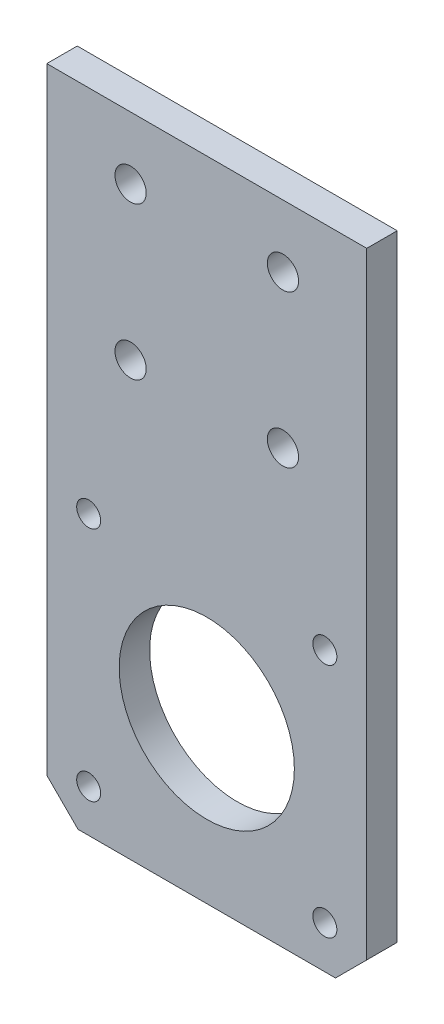
ISO-10303-21;
HEADER;
FILE_DESCRIPTION(('STEP AP214'),'2;1');
FILE_NAME('part.step','',(''),(''),'','','');
FILE_SCHEMA(('AUTOMOTIVE_DESIGN { 1 0 10303 214 1 1 1 1 }'));
ENDSEC;
DATA;
#1=APPLICATION_CONTEXT('core data for automotive mechanical design processes');
#2=APPLICATION_PROTOCOL_DEFINITION('international standard','automotive_design',2000,#1);
#3=PRODUCT_CONTEXT('',#1,'mechanical');
#4=PRODUCT('Part','Part','',(#3));
#5=PRODUCT_RELATED_PRODUCT_CATEGORY('part','',(#4));
#6=PRODUCT_DEFINITION_FORMATION('','',#4);
#7=PRODUCT_DEFINITION_CONTEXT('part definition',#1,'design');
#8=PRODUCT_DEFINITION('design','',#6,#7);
#9=PRODUCT_DEFINITION_SHAPE('','',#8);
#10=(LENGTH_UNIT() NAMED_UNIT(*) SI_UNIT(.MILLI.,.METRE.));
#11=(NAMED_UNIT(*) PLANE_ANGLE_UNIT() SI_UNIT($,.RADIAN.));
#12=(NAMED_UNIT(*) SI_UNIT($,.STERADIAN.) SOLID_ANGLE_UNIT());
#13=UNCERTAINTY_MEASURE_WITH_UNIT(LENGTH_MEASURE(1.E-05),#10,'distance_accuracy_value','');
#14=(GEOMETRIC_REPRESENTATION_CONTEXT(3) GLOBAL_UNCERTAINTY_ASSIGNED_CONTEXT((#13)) GLOBAL_UNIT_ASSIGNED_CONTEXT((#10,
#11,#12)) REPRESENTATION_CONTEXT('',''));
#15=CARTESIAN_POINT('',(0.,0.,0.));
#16=DIRECTION('',(0.,0.,1.));
#17=DIRECTION('',(1.,0.,0.));
#18=AXIS2_PLACEMENT_3D('',#15,#16,#17);
#19=CARTESIAN_POINT('',(0.,0.,4.));
#20=DIRECTION('',(0.,0.,1.));
#21=DIRECTION('',(1.,0.,0.));
#22=AXIS2_PLACEMENT_3D('',#19,#20,#21);
#23=PLANE('',#22);
#24=CARTESIAN_POINT('',(5.50000000000001,5.58,4.));
#25=DIRECTION('',(0.,0.,1.));
#26=DIRECTION('',(1.,0.,0.));
#27=AXIS2_PLACEMENT_3D('',#24,#25,#26);
#28=CIRCLE('',#27,1.575);
#29=CARTESIAN_POINT('',(7.07500000000001,5.58,4.));
#30=VERTEX_POINT('',#29);
#31=EDGE_CURVE('E193',#30,#30,#28,.T.);
#32=ORIENTED_EDGE('',*,*,#31,.F.);
#33=EDGE_LOOP('',(#32));
#34=FACE_BOUND('',#33,.T.);
#35=CARTESIAN_POINT('',(36.5,5.58,4.));
#36=DIRECTION('',(0.,0.,1.));
#37=DIRECTION('',(1.,0.,0.));
#38=AXIS2_PLACEMENT_3D('',#35,#36,#37);
#39=CIRCLE('',#38,1.575);
#40=CARTESIAN_POINT('',(38.075,5.58,4.));
#41=VERTEX_POINT('',#40);
#42=EDGE_CURVE('E187',#41,#41,#39,.T.);
#43=ORIENTED_EDGE('',*,*,#42,.F.);
#44=EDGE_LOOP('',(#43));
#45=FACE_BOUND('',#44,.T.);
#46=CARTESIAN_POINT('',(36.5,36.58,4.));
#47=DIRECTION('',(0.,0.,1.));
#48=DIRECTION('',(1.,0.,0.));
#49=AXIS2_PLACEMENT_3D('',#46,#47,#48);
#50=CIRCLE('',#49,1.575);
#51=CARTESIAN_POINT('',(38.075,36.58,4.));
#52=VERTEX_POINT('',#51);
#53=EDGE_CURVE('E181',#52,#52,#50,.T.);
#54=ORIENTED_EDGE('',*,*,#53,.F.);
#55=EDGE_LOOP('',(#54));
#56=FACE_BOUND('',#55,.T.);
#57=CARTESIAN_POINT('',(5.5,36.58,4.));
#58=DIRECTION('',(0.,0.,1.));
#59=DIRECTION('',(1.,0.,0.));
#60=AXIS2_PLACEMENT_3D('',#57,#58,#59);
#61=CIRCLE('',#60,1.575);
#62=CARTESIAN_POINT('',(7.075,36.58,4.));
#63=VERTEX_POINT('',#62);
#64=EDGE_CURVE('E175',#63,#63,#61,.T.);
#65=ORIENTED_EDGE('',*,*,#64,.F.);
#66=EDGE_LOOP('',(#65));
#67=FACE_BOUND('',#66,.T.);
#68=CARTESIAN_POINT('',(21.,21.08,4.));
#69=DIRECTION('',(0.,0.,1.));
#70=DIRECTION('',(1.,0.,0.));
#71=AXIS2_PLACEMENT_3D('',#68,#69,#70);
#72=CIRCLE('',#71,11.5);
#73=CARTESIAN_POINT('',(32.5,21.08,4.));
#74=VERTEX_POINT('',#73);
#75=EDGE_CURVE('E169',#74,#74,#72,.T.);
#76=ORIENTED_EDGE('',*,*,#75,.F.);
#77=EDGE_LOOP('',(#76));
#78=FACE_BOUND('',#77,.T.);
#79=CARTESIAN_POINT('',(11.,56.8,4.));
#80=DIRECTION('',(0.,0.,1.));
#81=DIRECTION('',(1.,0.,0.));
#82=AXIS2_PLACEMENT_3D('',#79,#80,#81);
#83=CIRCLE('',#82,2.05000000000001);
#84=CARTESIAN_POINT('',(13.05,56.8,4.));
#85=VERTEX_POINT('',#84);
#86=EDGE_CURVE('E160',#85,#85,#83,.T.);
#87=ORIENTED_EDGE('',*,*,#86,.F.);
#88=EDGE_LOOP('',(#87));
#89=FACE_BOUND('',#88,.T.);
#90=CARTESIAN_POINT('',(31.,76.8,4.));
#91=DIRECTION('',(0.,0.,1.));
#92=DIRECTION('',(1.,0.,0.));
#93=AXIS2_PLACEMENT_3D('',#90,#91,#92);
#94=CIRCLE('',#93,2.04999999999999);
#95=CARTESIAN_POINT('',(33.05,76.8,4.));
#96=VERTEX_POINT('',#95);
#97=EDGE_CURVE('E148',#96,#96,#94,.T.);
#98=ORIENTED_EDGE('',*,*,#97,.F.);
#99=EDGE_LOOP('',(#98));
#100=FACE_BOUND('',#99,.T.);
#101=DIRECTION('',(1.,0.,0.));
#102=VECTOR('',#101,1.);
#103=CARTESIAN_POINT('',(0.,0.,4.));
#104=LINE('',#103,#102);
#105=CARTESIAN_POINT('',(4.10000000000002,0.,4.));
#106=VERTEX_POINT('',#105);
#107=CARTESIAN_POINT('',(37.9,0.,4.));
#108=VERTEX_POINT('',#107);
#109=EDGE_CURVE('E96',#106,#108,#104,.T.);
#110=ORIENTED_EDGE('',*,*,#109,.T.);
#111=DIRECTION('',(-0.707106781186548,-0.707106781186548,0.));
#112=VECTOR('',#111,1.);
#113=CARTESIAN_POINT('',(18.95,-18.95,4.));
#114=LINE('',#113,#112);
#115=CARTESIAN_POINT('',(42.,4.10000000000004,4.));
#116=VERTEX_POINT('',#115);
#117=EDGE_CURVE('E40',#108,#116,#114,.F.);
#118=ORIENTED_EDGE('',*,*,#117,.T.);
#119=DIRECTION('',(0.,1.,0.));
#120=VECTOR('',#119,1.);
#121=CARTESIAN_POINT('',(42.,85.,4.));
#122=LINE('',#121,#120);
#123=CARTESIAN_POINT('',(42.,85.,4.));
#124=VERTEX_POINT('',#123);
#125=EDGE_CURVE('E86',#116,#124,#122,.T.);
#126=ORIENTED_EDGE('',*,*,#125,.T.);
#127=DIRECTION('',(-1.,0.,0.));
#128=VECTOR('',#127,1.);
#129=CARTESIAN_POINT('',(0.,85.,4.));
#130=LINE('',#129,#128);
#131=CARTESIAN_POINT('',(0.,85.,4.));
#132=VERTEX_POINT('',#131);
#133=EDGE_CURVE('E90',#124,#132,#130,.T.);
#134=ORIENTED_EDGE('',*,*,#133,.T.);
#135=DIRECTION('',(0.,-1.,0.));
#136=VECTOR('',#135,1.);
#137=CARTESIAN_POINT('',(0.,85.,4.));
#138=LINE('',#137,#136);
#139=CARTESIAN_POINT('',(0.,4.10000000000004,4.));
#140=VERTEX_POINT('',#139);
#141=EDGE_CURVE('E121',#132,#140,#138,.T.);
#142=ORIENTED_EDGE('',*,*,#141,.T.);
#143=DIRECTION('',(-0.707106781186548,0.707106781186548,0.));
#144=VECTOR('',#143,1.);
#145=CARTESIAN_POINT('',(2.05000000000001,2.05000000000001,4.));
#146=LINE('',#145,#144);
#147=EDGE_CURVE('E132',#140,#106,#146,.F.);
#148=ORIENTED_EDGE('',*,*,#147,.T.);
#149=EDGE_LOOP('',(#110,#118,#126,#134,#142,#148));
#150=FACE_BOUND('',#149,.T.);
#151=CARTESIAN_POINT('',(11.,76.8,4.));
#152=DIRECTION('',(0.,0.,1.));
#153=DIRECTION('',(1.,0.,0.));
#154=AXIS2_PLACEMENT_3D('',#151,#152,#153);
#155=CIRCLE('',#154,2.04999999999999);
#156=CARTESIAN_POINT('',(13.05,76.8,4.));
#157=VERTEX_POINT('',#156);
#158=EDGE_CURVE('E117',#157,#157,#155,.T.);
#159=ORIENTED_EDGE('',*,*,#158,.F.);
#160=EDGE_LOOP('',(#159));
#161=FACE_BOUND('',#160,.T.);
#162=CARTESIAN_POINT('',(31.,56.8,4.));
#163=DIRECTION('',(0.,0.,1.));
#164=DIRECTION('',(1.,0.,0.));
#165=AXIS2_PLACEMENT_3D('',#162,#163,#164);
#166=CIRCLE('',#165,2.04999999999999);
#167=CARTESIAN_POINT('',(33.05,56.8,4.));
#168=VERTEX_POINT('',#167);
#169=EDGE_CURVE('E154',#168,#168,#166,.T.);
#170=ORIENTED_EDGE('',*,*,#169,.F.);
#171=EDGE_LOOP('',(#170));
#172=FACE_BOUND('',#171,.T.);
#173=ADVANCED_FACE('F32',(#34,#45,#56,#67,#78,#89,#100,#150,#161,#172),#23,.T.);
#174=CARTESIAN_POINT('',(0.,0.,0.));
#175=DIRECTION('',(0.,0.,1.));
#176=DIRECTION('',(1.,0.,0.));
#177=AXIS2_PLACEMENT_3D('',#174,#175,#176);
#178=PLANE('',#177);
#179=CARTESIAN_POINT('',(5.50000000000001,5.58,0.));
#180=DIRECTION('',(0.,0.,1.));
#181=DIRECTION('',(1.,0.,0.));
#182=AXIS2_PLACEMENT_3D('',#179,#180,#181);
#183=CIRCLE('',#182,1.575);
#184=CARTESIAN_POINT('',(7.07500000000001,5.58,0.));
#185=VERTEX_POINT('',#184);
#186=EDGE_CURVE('E190',#185,#185,#183,.T.);
#187=ORIENTED_EDGE('',*,*,#186,.T.);
#188=EDGE_LOOP('',(#187));
#189=FACE_BOUND('',#188,.T.);
#190=CARTESIAN_POINT('',(36.5,5.58,0.));
#191=DIRECTION('',(0.,0.,1.));
#192=DIRECTION('',(1.,0.,0.));
#193=AXIS2_PLACEMENT_3D('',#190,#191,#192);
#194=CIRCLE('',#193,1.575);
#195=CARTESIAN_POINT('',(38.075,5.58,0.));
#196=VERTEX_POINT('',#195);
#197=EDGE_CURVE('E184',#196,#196,#194,.T.);
#198=ORIENTED_EDGE('',*,*,#197,.T.);
#199=EDGE_LOOP('',(#198));
#200=FACE_BOUND('',#199,.T.);
#201=CARTESIAN_POINT('',(36.5,36.58,0.));
#202=DIRECTION('',(0.,0.,1.));
#203=DIRECTION('',(1.,0.,0.));
#204=AXIS2_PLACEMENT_3D('',#201,#202,#203);
#205=CIRCLE('',#204,1.575);
#206=CARTESIAN_POINT('',(38.075,36.58,0.));
#207=VERTEX_POINT('',#206);
#208=EDGE_CURVE('E178',#207,#207,#205,.T.);
#209=ORIENTED_EDGE('',*,*,#208,.T.);
#210=EDGE_LOOP('',(#209));
#211=FACE_BOUND('',#210,.T.);
#212=CARTESIAN_POINT('',(5.5,36.58,0.));
#213=DIRECTION('',(0.,0.,1.));
#214=DIRECTION('',(1.,0.,0.));
#215=AXIS2_PLACEMENT_3D('',#212,#213,#214);
#216=CIRCLE('',#215,1.575);
#217=CARTESIAN_POINT('',(7.075,36.58,0.));
#218=VERTEX_POINT('',#217);
#219=EDGE_CURVE('E172',#218,#218,#216,.T.);
#220=ORIENTED_EDGE('',*,*,#219,.T.);
#221=EDGE_LOOP('',(#220));
#222=FACE_BOUND('',#221,.T.);
#223=CARTESIAN_POINT('',(21.,21.08,0.));
#224=DIRECTION('',(0.,0.,1.));
#225=DIRECTION('',(1.,0.,0.));
#226=AXIS2_PLACEMENT_3D('',#223,#224,#225);
#227=CIRCLE('',#226,11.5);
#228=CARTESIAN_POINT('',(32.5,21.08,0.));
#229=VERTEX_POINT('',#228);
#230=EDGE_CURVE('E166',#229,#229,#227,.T.);
#231=ORIENTED_EDGE('',*,*,#230,.T.);
#232=EDGE_LOOP('',(#231));
#233=FACE_BOUND('',#232,.T.);
#234=DIRECTION('',(0.,1.,0.));
#235=VECTOR('',#234,1.);
#236=CARTESIAN_POINT('',(42.,85.,0.));
#237=LINE('',#236,#235);
#238=CARTESIAN_POINT('',(42.,4.10000000000004,0.));
#239=VERTEX_POINT('',#238);
#240=CARTESIAN_POINT('',(42.,85.,0.));
#241=VERTEX_POINT('',#240);
#242=EDGE_CURVE('E102',#239,#241,#237,.T.);
#243=ORIENTED_EDGE('',*,*,#242,.F.);
#244=DIRECTION('',(0.707106781186548,0.707106781186548,0.));
#245=VECTOR('',#244,1.);
#246=CARTESIAN_POINT('',(42.,4.10000000000002,0.));
#247=LINE('',#246,#245);
#248=CARTESIAN_POINT('',(37.9,0.,0.));
#249=VERTEX_POINT('',#248);
#250=EDGE_CURVE('E126',#239,#249,#247,.F.);
#251=ORIENTED_EDGE('',*,*,#250,.T.);
#252=DIRECTION('',(1.,0.,0.));
#253=VECTOR('',#252,1.);
#254=CARTESIAN_POINT('',(0.,0.,0.));
#255=LINE('',#254,#253);
#256=CARTESIAN_POINT('',(4.10000000000002,0.,0.));
#257=VERTEX_POINT('',#256);
#258=EDGE_CURVE('E116',#257,#249,#255,.T.);
#259=ORIENTED_EDGE('',*,*,#258,.F.);
#260=DIRECTION('',(0.707106781186548,-0.707106781186548,0.));
#261=VECTOR('',#260,1.);
#262=CARTESIAN_POINT('',(4.10000000000002,0.,0.));
#263=LINE('',#262,#261);
#264=CARTESIAN_POINT('',(0.,4.10000000000002,0.));
#265=VERTEX_POINT('',#264);
#266=EDGE_CURVE('E124',#257,#265,#263,.F.);
#267=ORIENTED_EDGE('',*,*,#266,.T.);
#268=DIRECTION('',(0.,-1.,0.));
#269=VECTOR('',#268,1.);
#270=CARTESIAN_POINT('',(0.,85.,0.));
#271=LINE('',#270,#269);
#272=CARTESIAN_POINT('',(0.,85.,0.));
#273=VERTEX_POINT('',#272);
#274=EDGE_CURVE('E114',#273,#265,#271,.T.);
#275=ORIENTED_EDGE('',*,*,#274,.F.);
#276=DIRECTION('',(-1.,0.,0.));
#277=VECTOR('',#276,1.);
#278=CARTESIAN_POINT('',(0.,85.,0.));
#279=LINE('',#278,#277);
#280=EDGE_CURVE('E120',#241,#273,#279,.T.);
#281=ORIENTED_EDGE('',*,*,#280,.F.);
#282=EDGE_LOOP('',(#243,#251,#259,#267,#275,#281));
#283=FACE_BOUND('',#282,.T.);
#284=CARTESIAN_POINT('',(11.,76.8,0.));
#285=DIRECTION('',(0.,0.,1.));
#286=DIRECTION('',(1.,0.,0.));
#287=AXIS2_PLACEMENT_3D('',#284,#285,#286);
#288=CIRCLE('',#287,2.04999999999999);
#289=CARTESIAN_POINT('',(13.05,76.8,0.));
#290=VERTEX_POINT('',#289);
#291=EDGE_CURVE('E145',#290,#290,#288,.T.);
#292=ORIENTED_EDGE('',*,*,#291,.T.);
#293=EDGE_LOOP('',(#292));
#294=FACE_BOUND('',#293,.T.);
#295=CARTESIAN_POINT('',(31.,76.8,0.));
#296=DIRECTION('',(0.,0.,1.));
#297=DIRECTION('',(1.,0.,0.));
#298=AXIS2_PLACEMENT_3D('',#295,#296,#297);
#299=CIRCLE('',#298,2.04999999999999);
#300=CARTESIAN_POINT('',(33.05,76.8,0.));
#301=VERTEX_POINT('',#300);
#302=EDGE_CURVE('E151',#301,#301,#299,.T.);
#303=ORIENTED_EDGE('',*,*,#302,.T.);
#304=EDGE_LOOP('',(#303));
#305=FACE_BOUND('',#304,.T.);
#306=CARTESIAN_POINT('',(31.,56.8,0.));
#307=DIRECTION('',(0.,0.,1.));
#308=DIRECTION('',(1.,0.,0.));
#309=AXIS2_PLACEMENT_3D('',#306,#307,#308);
#310=CIRCLE('',#309,2.04999999999999);
#311=CARTESIAN_POINT('',(33.05,56.8,0.));
#312=VERTEX_POINT('',#311);
#313=EDGE_CURVE('E157',#312,#312,#310,.T.);
#314=ORIENTED_EDGE('',*,*,#313,.T.);
#315=EDGE_LOOP('',(#314));
#316=FACE_BOUND('',#315,.T.);
#317=CARTESIAN_POINT('',(11.,56.8,0.));
#318=DIRECTION('',(0.,0.,1.));
#319=DIRECTION('',(1.,0.,0.));
#320=AXIS2_PLACEMENT_3D('',#317,#318,#319);
#321=CIRCLE('',#320,2.05000000000001);
#322=CARTESIAN_POINT('',(13.05,56.8,0.));
#323=VERTEX_POINT('',#322);
#324=EDGE_CURVE('E163',#323,#323,#321,.T.);
#325=ORIENTED_EDGE('',*,*,#324,.T.);
#326=EDGE_LOOP('',(#325));
#327=FACE_BOUND('',#326,.T.);
#328=ADVANCED_FACE('F140',(#189,#200,#211,#222,#233,#283,#294,#305,#316,#327),#178,.F.);
#329=CARTESIAN_POINT('',(0.,85.,4.));
#330=DIRECTION('',(1.,0.,0.));
#331=DIRECTION('',(0.,1.,0.));
#332=AXIS2_PLACEMENT_3D('',#329,#330,#331);
#333=PLANE('',#332);
#334=ORIENTED_EDGE('',*,*,#274,.T.);
#335=DIRECTION('',(0.,0.,1.));
#336=VECTOR('',#335,1.);
#337=CARTESIAN_POINT('',(0.,4.10000000000002,4.));
#338=LINE('',#337,#336);
#339=EDGE_CURVE('E11',#265,#140,#338,.T.);
#340=ORIENTED_EDGE('',*,*,#339,.T.);
#341=ORIENTED_EDGE('',*,*,#141,.F.);
#342=DIRECTION('',(0.,0.,-1.));
#343=VECTOR('',#342,1.);
#344=CARTESIAN_POINT('',(0.,85.,4.));
#345=LINE('',#344,#343);
#346=EDGE_CURVE('E106',#132,#273,#345,.T.);
#347=ORIENTED_EDGE('',*,*,#346,.T.);
#348=EDGE_LOOP('',(#334,#340,#341,#347));
#349=FACE_BOUND('',#348,.T.);
#350=ADVANCED_FACE('F142',(#349),#333,.F.);
#351=CARTESIAN_POINT('',(0.,0.,4.));
#352=DIRECTION('',(0.,1.,0.));
#353=DIRECTION('',(0.,0.,1.));
#354=AXIS2_PLACEMENT_3D('',#351,#352,#353);
#355=PLANE('',#354);
#356=ORIENTED_EDGE('',*,*,#258,.T.);
#357=DIRECTION('',(0.,0.,1.));
#358=VECTOR('',#357,1.);
#359=CARTESIAN_POINT('',(37.9,0.,4.));
#360=LINE('',#359,#358);
#361=EDGE_CURVE('E53',#249,#108,#360,.T.);
#362=ORIENTED_EDGE('',*,*,#361,.T.);
#363=ORIENTED_EDGE('',*,*,#109,.F.);
#364=DIRECTION('',(0.,0.,-1.));
#365=VECTOR('',#364,1.);
#366=CARTESIAN_POINT('',(4.10000000000002,0.,4.));
#367=LINE('',#366,#365);
#368=EDGE_CURVE('E128',#106,#257,#367,.T.);
#369=ORIENTED_EDGE('',*,*,#368,.T.);
#370=EDGE_LOOP('',(#356,#362,#363,#369));
#371=FACE_BOUND('',#370,.T.);
#372=ADVANCED_FACE('F136',(#371),#355,.F.);
#373=CARTESIAN_POINT('',(42.,85.,4.));
#374=DIRECTION('',(-1.,0.,0.));
#375=DIRECTION('',(0.,0.,1.));
#376=AXIS2_PLACEMENT_3D('',#373,#374,#375);
#377=PLANE('',#376);
#378=ORIENTED_EDGE('',*,*,#125,.F.);
#379=DIRECTION('',(0.,0.,-1.));
#380=VECTOR('',#379,1.);
#381=CARTESIAN_POINT('',(42.,4.10000000000002,4.));
#382=LINE('',#381,#380);
#383=EDGE_CURVE('E105',#116,#239,#382,.T.);
#384=ORIENTED_EDGE('',*,*,#383,.T.);
#385=ORIENTED_EDGE('',*,*,#242,.T.);
#386=DIRECTION('',(0.,0.,-1.));
#387=VECTOR('',#386,1.);
#388=CARTESIAN_POINT('',(42.,85.,4.));
#389=LINE('',#388,#387);
#390=EDGE_CURVE('E99',#124,#241,#389,.T.);
#391=ORIENTED_EDGE('',*,*,#390,.F.);
#392=EDGE_LOOP('',(#378,#384,#385,#391));
#393=FACE_BOUND('',#392,.T.);
#394=ADVANCED_FACE('F100',(#393),#377,.F.);
#395=CARTESIAN_POINT('',(0.,85.,4.));
#396=DIRECTION('',(0.,-1.,0.));
#397=DIRECTION('',(0.,0.,-1.));
#398=AXIS2_PLACEMENT_3D('',#395,#396,#397);
#399=PLANE('',#398);
#400=ORIENTED_EDGE('',*,*,#280,.T.);
#401=ORIENTED_EDGE('',*,*,#346,.F.);
#402=ORIENTED_EDGE('',*,*,#133,.F.);
#403=ORIENTED_EDGE('',*,*,#390,.T.);
#404=EDGE_LOOP('',(#400,#401,#402,#403));
#405=FACE_BOUND('',#404,.T.);
#406=ADVANCED_FACE('F108',(#405),#399,.F.);
#407=CARTESIAN_POINT('',(11.,76.8,4.));
#408=DIRECTION('',(0.,0.,-1.));
#409=DIRECTION('',(-1.,0.,0.));
#410=AXIS2_PLACEMENT_3D('',#407,#408,#409);
#411=CYLINDRICAL_SURFACE('',#410,2.04999999999999);
#412=ORIENTED_EDGE('',*,*,#158,.T.);
#413=EDGE_LOOP('',(#412));
#414=FACE_BOUND('',#413,.T.);
#415=ORIENTED_EDGE('',*,*,#291,.F.);
#416=EDGE_LOOP('',(#415));
#417=FACE_BOUND('',#416,.T.);
#418=ADVANCED_FACE('F228',(#414,#417),#411,.F.);
#419=CARTESIAN_POINT('',(31.,76.8,4.));
#420=DIRECTION('',(0.,0.,-1.));
#421=DIRECTION('',(-1.,0.,0.));
#422=AXIS2_PLACEMENT_3D('',#419,#420,#421);
#423=CYLINDRICAL_SURFACE('',#422,2.04999999999999);
#424=ORIENTED_EDGE('',*,*,#97,.T.);
#425=EDGE_LOOP('',(#424));
#426=FACE_BOUND('',#425,.T.);
#427=ORIENTED_EDGE('',*,*,#302,.F.);
#428=EDGE_LOOP('',(#427));
#429=FACE_BOUND('',#428,.T.);
#430=ADVANCED_FACE('F224',(#426,#429),#423,.F.);
#431=CARTESIAN_POINT('',(31.,56.8,4.));
#432=DIRECTION('',(0.,0.,-1.));
#433=DIRECTION('',(-1.,0.,0.));
#434=AXIS2_PLACEMENT_3D('',#431,#432,#433);
#435=CYLINDRICAL_SURFACE('',#434,2.04999999999999);
#436=ORIENTED_EDGE('',*,*,#169,.T.);
#437=EDGE_LOOP('',(#436));
#438=FACE_BOUND('',#437,.T.);
#439=ORIENTED_EDGE('',*,*,#313,.F.);
#440=EDGE_LOOP('',(#439));
#441=FACE_BOUND('',#440,.T.);
#442=ADVANCED_FACE('F227',(#438,#441),#435,.F.);
#443=CARTESIAN_POINT('',(11.,56.8,4.));
#444=DIRECTION('',(0.,0.,-1.));
#445=DIRECTION('',(-1.,0.,0.));
#446=AXIS2_PLACEMENT_3D('',#443,#444,#445);
#447=CYLINDRICAL_SURFACE('',#446,2.05000000000001);
#448=ORIENTED_EDGE('',*,*,#86,.T.);
#449=EDGE_LOOP('',(#448));
#450=FACE_BOUND('',#449,.T.);
#451=ORIENTED_EDGE('',*,*,#324,.F.);
#452=EDGE_LOOP('',(#451));
#453=FACE_BOUND('',#452,.T.);
#454=ADVANCED_FACE('F239',(#450,#453),#447,.F.);
#455=CARTESIAN_POINT('',(21.,21.08,0.));
#456=DIRECTION('',(0.,0.,1.));
#457=DIRECTION('',(1.,0.,0.));
#458=AXIS2_PLACEMENT_3D('',#455,#456,#457);
#459=CYLINDRICAL_SURFACE('',#458,11.5);
#460=ORIENTED_EDGE('',*,*,#230,.F.);
#461=EDGE_LOOP('',(#460));
#462=FACE_BOUND('',#461,.T.);
#463=ORIENTED_EDGE('',*,*,#75,.T.);
#464=EDGE_LOOP('',(#463));
#465=FACE_BOUND('',#464,.T.);
#466=ADVANCED_FACE('F241',(#462,#465),#459,.F.);
#467=CARTESIAN_POINT('',(5.5,36.58,0.));
#468=DIRECTION('',(0.,0.,1.));
#469=DIRECTION('',(1.,0.,0.));
#470=AXIS2_PLACEMENT_3D('',#467,#468,#469);
#471=CYLINDRICAL_SURFACE('',#470,1.575);
#472=ORIENTED_EDGE('',*,*,#219,.F.);
#473=EDGE_LOOP('',(#472));
#474=FACE_BOUND('',#473,.T.);
#475=ORIENTED_EDGE('',*,*,#64,.T.);
#476=EDGE_LOOP('',(#475));
#477=FACE_BOUND('',#476,.T.);
#478=ADVANCED_FACE('F248',(#474,#477),#471,.F.);
#479=CARTESIAN_POINT('',(36.5,36.58,0.));
#480=DIRECTION('',(0.,0.,1.));
#481=DIRECTION('',(1.,0.,0.));
#482=AXIS2_PLACEMENT_3D('',#479,#480,#481);
#483=CYLINDRICAL_SURFACE('',#482,1.575);
#484=ORIENTED_EDGE('',*,*,#208,.F.);
#485=EDGE_LOOP('',(#484));
#486=FACE_BOUND('',#485,.T.);
#487=ORIENTED_EDGE('',*,*,#53,.T.);
#488=EDGE_LOOP('',(#487));
#489=FACE_BOUND('',#488,.T.);
#490=ADVANCED_FACE('F322',(#486,#489),#483,.F.);
#491=CARTESIAN_POINT('',(36.5,5.58,0.));
#492=DIRECTION('',(0.,0.,1.));
#493=DIRECTION('',(1.,0.,0.));
#494=AXIS2_PLACEMENT_3D('',#491,#492,#493);
#495=CYLINDRICAL_SURFACE('',#494,1.575);
#496=ORIENTED_EDGE('',*,*,#197,.F.);
#497=EDGE_LOOP('',(#496));
#498=FACE_BOUND('',#497,.T.);
#499=ORIENTED_EDGE('',*,*,#42,.T.);
#500=EDGE_LOOP('',(#499));
#501=FACE_BOUND('',#500,.T.);
#502=ADVANCED_FACE('F205',(#498,#501),#495,.F.);
#503=CARTESIAN_POINT('',(5.50000000000001,5.58,0.));
#504=DIRECTION('',(0.,0.,1.));
#505=DIRECTION('',(1.,0.,0.));
#506=AXIS2_PLACEMENT_3D('',#503,#504,#505);
#507=CYLINDRICAL_SURFACE('',#506,1.575);
#508=ORIENTED_EDGE('',*,*,#186,.F.);
#509=EDGE_LOOP('',(#508));
#510=FACE_BOUND('',#509,.T.);
#511=ORIENTED_EDGE('',*,*,#31,.T.);
#512=EDGE_LOOP('',(#511));
#513=FACE_BOUND('',#512,.T.);
#514=ADVANCED_FACE('F201',(#510,#513),#507,.F.);
#515=CARTESIAN_POINT('',(42.,4.10000000000002,4.));
#516=DIRECTION('',(-0.707106781186548,0.707106781186548,0.));
#517=DIRECTION('',(0.,0.,-1.));
#518=AXIS2_PLACEMENT_3D('',#515,#516,#517);
#519=PLANE('',#518);
#520=ORIENTED_EDGE('',*,*,#117,.F.);
#521=ORIENTED_EDGE('',*,*,#361,.F.);
#522=ORIENTED_EDGE('',*,*,#250,.F.);
#523=ORIENTED_EDGE('',*,*,#383,.F.);
#524=EDGE_LOOP('',(#520,#521,#522,#523));
#525=FACE_BOUND('',#524,.T.);
#526=ADVANCED_FACE('F204',(#525),#519,.F.);
#527=CARTESIAN_POINT('',(4.10000000000002,0.,4.));
#528=DIRECTION('',(0.707106781186548,0.707106781186548,0.));
#529=DIRECTION('',(0.,0.,-1.));
#530=AXIS2_PLACEMENT_3D('',#527,#528,#529);
#531=PLANE('',#530);
#532=ORIENTED_EDGE('',*,*,#147,.F.);
#533=ORIENTED_EDGE('',*,*,#339,.F.);
#534=ORIENTED_EDGE('',*,*,#266,.F.);
#535=ORIENTED_EDGE('',*,*,#368,.F.);
#536=EDGE_LOOP('',(#532,#533,#534,#535));
#537=FACE_BOUND('',#536,.T.);
#538=ADVANCED_FACE('F34',(#537),#531,.F.);
#539=CLOSED_SHELL('',(#173,#328,#350,#372,#394,#406,#418,#430,#442,#454,#466,#478,#490,#502,
#514,#526,#538));
#540=MANIFOLD_SOLID_BREP('B2',#539);
#541=ADVANCED_BREP_SHAPE_REPRESENTATION('',(#18,#540),#14);
#542=SHAPE_DEFINITION_REPRESENTATION(#9,#541);
ENDSEC;
END-ISO-10303-21;
